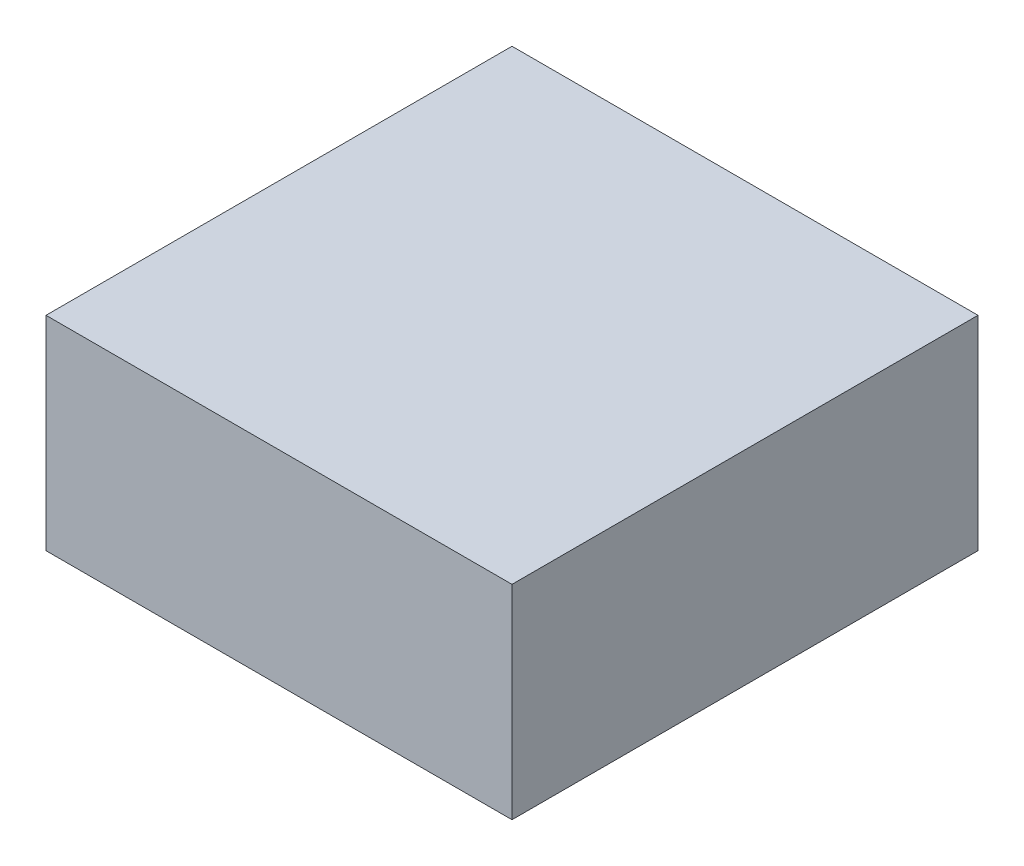
ISO-10303-21;
HEADER;
FILE_DESCRIPTION(('STEP AP214'),'2;1');
FILE_NAME('part.step','',(''),(''),'','','');
FILE_SCHEMA(('AUTOMOTIVE_DESIGN { 1 0 10303 214 1 1 1 1 }'));
ENDSEC;
DATA;
#1=APPLICATION_CONTEXT('core data for automotive mechanical design processes');
#2=APPLICATION_PROTOCOL_DEFINITION('international standard','automotive_design',2000,#1);
#3=PRODUCT_CONTEXT('',#1,'mechanical');
#4=PRODUCT('Part','Part','',(#3));
#5=PRODUCT_RELATED_PRODUCT_CATEGORY('part','',(#4));
#6=PRODUCT_DEFINITION_FORMATION('','',#4);
#7=PRODUCT_DEFINITION_CONTEXT('part definition',#1,'design');
#8=PRODUCT_DEFINITION('design','',#6,#7);
#9=PRODUCT_DEFINITION_SHAPE('','',#8);
#10=(LENGTH_UNIT() NAMED_UNIT(*) SI_UNIT(.MILLI.,.METRE.));
#11=(NAMED_UNIT(*) PLANE_ANGLE_UNIT() SI_UNIT($,.RADIAN.));
#12=(NAMED_UNIT(*) SI_UNIT($,.STERADIAN.) SOLID_ANGLE_UNIT());
#13=UNCERTAINTY_MEASURE_WITH_UNIT(LENGTH_MEASURE(1.E-05),#10,'distance_accuracy_value','');
#14=(GEOMETRIC_REPRESENTATION_CONTEXT(3) GLOBAL_UNCERTAINTY_ASSIGNED_CONTEXT((#13)) GLOBAL_UNIT_ASSIGNED_CONTEXT((#10,
#11,#12)) REPRESENTATION_CONTEXT('',''));
#15=CARTESIAN_POINT('',(0.,0.,0.));
#16=DIRECTION('',(0.,0.,1.));
#17=DIRECTION('',(1.,0.,0.));
#18=AXIS2_PLACEMENT_3D('',#15,#16,#17);
#19=CARTESIAN_POINT('',(-0.3999992,-0.17499838,0.));
#20=DIRECTION('',(0.,1.,0.));
#21=DIRECTION('',(0.,0.,1.));
#22=AXIS2_PLACEMENT_3D('',#19,#20,#21);
#23=PLANE('',#22);
#24=DIRECTION('',(0.,0.,1.));
#25=VECTOR('',#24,1.);
#26=CARTESIAN_POINT('',(0.40000174,-0.17499838,0.));
#27=LINE('',#26,#25);
#28=CARTESIAN_POINT('',(0.40000174,-0.17499838,0.));
#29=VERTEX_POINT('',#28);
#30=CARTESIAN_POINT('',(0.40000174,-0.17499838,0.80000094));
#31=VERTEX_POINT('',#30);
#32=EDGE_CURVE('E20',#29,#31,#27,.T.);
#33=ORIENTED_EDGE('',*,*,#32,.T.);
#34=DIRECTION('',(-1.,0.,0.));
#35=VECTOR('',#34,1.);
#36=CARTESIAN_POINT('',(0.40000174,-0.17499838,0.80000094));
#37=LINE('',#36,#35);
#38=CARTESIAN_POINT('',(-0.3999992,-0.17499838,0.80000094));
#39=VERTEX_POINT('',#38);
#40=EDGE_CURVE('E55',#31,#39,#37,.T.);
#41=ORIENTED_EDGE('',*,*,#40,.T.);
#42=DIRECTION('',(0.,0.,-1.));
#43=VECTOR('',#42,1.);
#44=CARTESIAN_POINT('',(-0.3999992,-0.17499838,0.));
#45=LINE('',#44,#43);
#46=CARTESIAN_POINT('',(-0.3999992,-0.17499838,0.));
#47=VERTEX_POINT('',#46);
#48=EDGE_CURVE('E76',#39,#47,#45,.T.);
#49=ORIENTED_EDGE('',*,*,#48,.T.);
#50=DIRECTION('',(-1.,0.,0.));
#51=VECTOR('',#50,1.);
#52=CARTESIAN_POINT('',(0.40000174,-0.17499838,0.));
#53=LINE('',#52,#51);
#54=EDGE_CURVE('E58',#29,#47,#53,.T.);
#55=ORIENTED_EDGE('',*,*,#54,.F.);
#56=EDGE_LOOP('',(#33,#41,#49,#55));
#57=FACE_BOUND('',#56,.T.);
#58=ADVANCED_FACE('F17',(#57),#23,.F.);
#59=CARTESIAN_POINT('',(0.40000174,-0.17499838,0.));
#60=DIRECTION('',(-1.,0.,0.));
#61=DIRECTION('',(0.,0.,1.));
#62=AXIS2_PLACEMENT_3D('',#59,#60,#61);
#63=PLANE('',#62);
#64=DIRECTION('',(0.,0.,-1.));
#65=VECTOR('',#64,1.);
#66=CARTESIAN_POINT('',(0.40000174,0.17500092,0.));
#67=LINE('',#66,#65);
#68=CARTESIAN_POINT('',(0.40000174,0.17500092,0.));
#69=VERTEX_POINT('',#68);
#70=CARTESIAN_POINT('',(0.40000174,0.17500092,0.80000094));
#71=VERTEX_POINT('',#70);
#72=EDGE_CURVE('E73',#69,#71,#67,.F.);
#73=ORIENTED_EDGE('',*,*,#72,.T.);
#74=DIRECTION('',(0.,1.,0.));
#75=VECTOR('',#74,1.);
#76=CARTESIAN_POINT('',(0.40000174,0.17500092,0.80000094));
#77=LINE('',#76,#75);
#78=EDGE_CURVE('E63',#71,#31,#77,.F.);
#79=ORIENTED_EDGE('',*,*,#78,.T.);
#80=ORIENTED_EDGE('',*,*,#32,.F.);
#81=DIRECTION('',(0.,1.,0.));
#82=VECTOR('',#81,1.);
#83=CARTESIAN_POINT('',(0.40000174,0.17500092,0.));
#84=LINE('',#83,#82);
#85=EDGE_CURVE('E78',#69,#29,#84,.F.);
#86=ORIENTED_EDGE('',*,*,#85,.F.);
#87=EDGE_LOOP('',(#73,#79,#80,#86));
#88=FACE_BOUND('',#87,.T.);
#89=ADVANCED_FACE('F72',(#88),#63,.F.);
#90=CARTESIAN_POINT('',(0.40000174,0.17500092,0.80000094));
#91=DIRECTION('',(0.,0.,-1.));
#92=DIRECTION('',(-1.,0.,0.));
#93=AXIS2_PLACEMENT_3D('',#90,#91,#92);
#94=PLANE('',#93);
#95=DIRECTION('',(0.,1.,0.));
#96=VECTOR('',#95,1.);
#97=CARTESIAN_POINT('',(-0.3999992,0.17500092,0.80000094));
#98=LINE('',#97,#96);
#99=CARTESIAN_POINT('',(-0.3999992,0.17500092,0.80000094));
#100=VERTEX_POINT('',#99);
#101=EDGE_CURVE('E69',#100,#39,#98,.F.);
#102=ORIENTED_EDGE('',*,*,#101,.T.);
#103=ORIENTED_EDGE('',*,*,#40,.F.);
#104=ORIENTED_EDGE('',*,*,#78,.F.);
#105=DIRECTION('',(1.,0.,0.));
#106=VECTOR('',#105,1.);
#107=CARTESIAN_POINT('',(0.40000174,0.17500092,0.80000094));
#108=LINE('',#107,#106);
#109=EDGE_CURVE('E83',#71,#100,#108,.F.);
#110=ORIENTED_EDGE('',*,*,#109,.T.);
#111=EDGE_LOOP('',(#102,#103,#104,#110));
#112=FACE_BOUND('',#111,.T.);
#113=ADVANCED_FACE('F66',(#112),#94,.F.);
#114=CARTESIAN_POINT('',(-0.3999992,0.17500092,0.));
#115=DIRECTION('',(1.,0.,0.));
#116=DIRECTION('',(0.,0.,-1.));
#117=AXIS2_PLACEMENT_3D('',#114,#115,#116);
#118=PLANE('',#117);
#119=ORIENTED_EDGE('',*,*,#48,.F.);
#120=ORIENTED_EDGE('',*,*,#101,.F.);
#121=DIRECTION('',(0.,0.,-1.));
#122=VECTOR('',#121,1.);
#123=CARTESIAN_POINT('',(-0.3999992,0.17500092,0.));
#124=LINE('',#123,#122);
#125=CARTESIAN_POINT('',(-0.3999992,0.17500092,0.));
#126=VERTEX_POINT('',#125);
#127=EDGE_CURVE('E26',#100,#126,#124,.T.);
#128=ORIENTED_EDGE('',*,*,#127,.T.);
#129=DIRECTION('',(0.,1.,0.));
#130=VECTOR('',#129,1.);
#131=CARTESIAN_POINT('',(-0.3999992,0.17500092,0.));
#132=LINE('',#131,#130);
#133=EDGE_CURVE('E34',#47,#126,#132,.T.);
#134=ORIENTED_EDGE('',*,*,#133,.F.);
#135=EDGE_LOOP('',(#119,#120,#128,#134));
#136=FACE_BOUND('',#135,.T.);
#137=ADVANCED_FACE('F88',(#136),#118,.F.);
#138=CARTESIAN_POINT('',(0.40000174,0.17500092,0.));
#139=DIRECTION('',(0.,0.,-1.));
#140=DIRECTION('',(-1.,0.,0.));
#141=AXIS2_PLACEMENT_3D('',#138,#139,#140);
#142=PLANE('',#141);
#143=ORIENTED_EDGE('',*,*,#133,.T.);
#144=DIRECTION('',(1.,0.,0.));
#145=VECTOR('',#144,1.);
#146=CARTESIAN_POINT('',(0.40000174,0.17500092,0.));
#147=LINE('',#146,#145);
#148=EDGE_CURVE('E11',#126,#69,#147,.T.);
#149=ORIENTED_EDGE('',*,*,#148,.T.);
#150=ORIENTED_EDGE('',*,*,#85,.T.);
#151=ORIENTED_EDGE('',*,*,#54,.T.);
#152=EDGE_LOOP('',(#143,#149,#150,#151));
#153=FACE_BOUND('',#152,.T.);
#154=ADVANCED_FACE('F91',(#153),#142,.T.);
#155=CARTESIAN_POINT('',(0.40000174,0.17500092,0.));
#156=DIRECTION('',(0.,-1.,0.));
#157=DIRECTION('',(0.,0.,-1.));
#158=AXIS2_PLACEMENT_3D('',#155,#156,#157);
#159=PLANE('',#158);
#160=ORIENTED_EDGE('',*,*,#127,.F.);
#161=ORIENTED_EDGE('',*,*,#109,.F.);
#162=ORIENTED_EDGE('',*,*,#72,.F.);
#163=ORIENTED_EDGE('',*,*,#148,.F.);
#164=EDGE_LOOP('',(#160,#161,#162,#163));
#165=FACE_BOUND('',#164,.T.);
#166=ADVANCED_FACE('F90',(#165),#159,.F.);
#167=CLOSED_SHELL('',(#58,#89,#113,#137,#154,#166));
#168=MANIFOLD_SOLID_BREP('B1',#167);
#169=ADVANCED_BREP_SHAPE_REPRESENTATION('',(#18,#168),#14);
#170=SHAPE_DEFINITION_REPRESENTATION(#9,#169);
ENDSEC;
END-ISO-10303-21;
